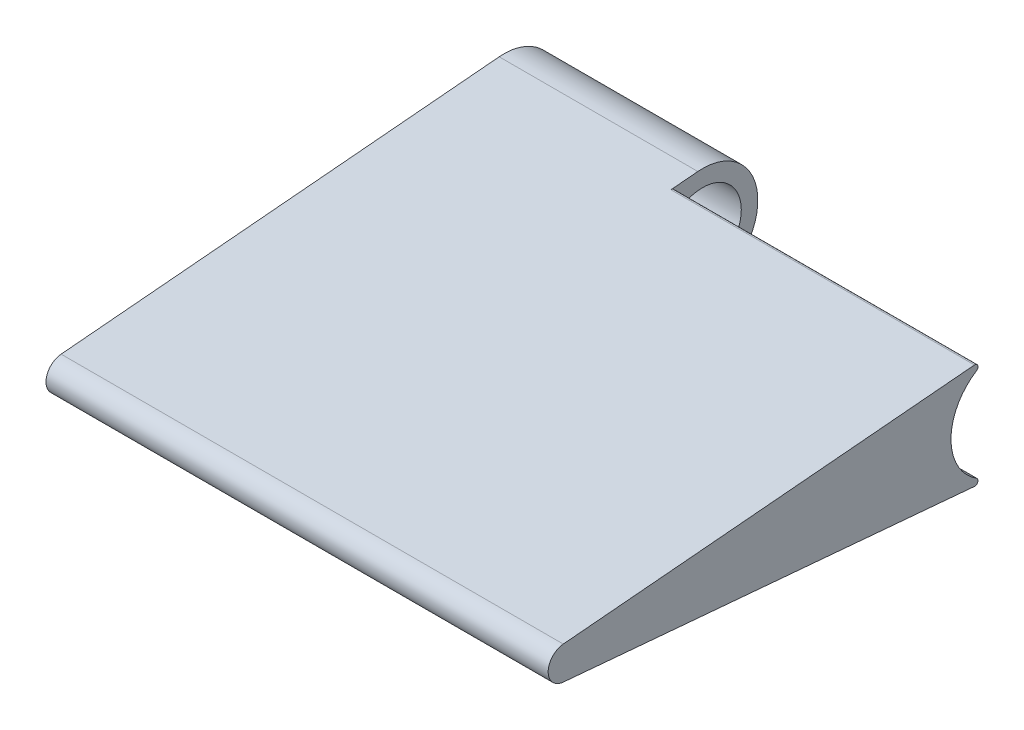
ISO-10303-21;
HEADER;
FILE_DESCRIPTION(('STEP AP214'),'2;1');
FILE_NAME('part.step','',(''),(''),'','','');
FILE_SCHEMA(('AUTOMOTIVE_DESIGN { 1 0 10303 214 1 1 1 1 }'));
ENDSEC;
DATA;
#1=APPLICATION_CONTEXT('core data for automotive mechanical design processes');
#2=APPLICATION_PROTOCOL_DEFINITION('international standard','automotive_design',2000,#1);
#3=PRODUCT_CONTEXT('',#1,'mechanical');
#4=PRODUCT('Part','Part','',(#3));
#5=PRODUCT_RELATED_PRODUCT_CATEGORY('part','',(#4));
#6=PRODUCT_DEFINITION_FORMATION('','',#4);
#7=PRODUCT_DEFINITION_CONTEXT('part definition',#1,'design');
#8=PRODUCT_DEFINITION('design','',#6,#7);
#9=PRODUCT_DEFINITION_SHAPE('','',#8);
#10=(LENGTH_UNIT() NAMED_UNIT(*) SI_UNIT(.MILLI.,.METRE.));
#11=(NAMED_UNIT(*) PLANE_ANGLE_UNIT() SI_UNIT($,.RADIAN.));
#12=(NAMED_UNIT(*) SI_UNIT($,.STERADIAN.) SOLID_ANGLE_UNIT());
#13=UNCERTAINTY_MEASURE_WITH_UNIT(LENGTH_MEASURE(1.E-05),#10,'distance_accuracy_value','');
#14=(GEOMETRIC_REPRESENTATION_CONTEXT(3) GLOBAL_UNCERTAINTY_ASSIGNED_CONTEXT((#13)) GLOBAL_UNIT_ASSIGNED_CONTEXT((#10,
#11,#12)) REPRESENTATION_CONTEXT('',''));
#15=CARTESIAN_POINT('',(0.,0.,0.));
#16=DIRECTION('',(0.,0.,1.));
#17=DIRECTION('',(1.,0.,0.));
#18=AXIS2_PLACEMENT_3D('',#15,#16,#17);
#19=CARTESIAN_POINT('',(27.5,-6.62708288224904,-18.304740975765));
#20=DIRECTION('',(0.,0.996164519544839,-0.0875));
#21=DIRECTION('',(0.,0.0875,0.996164519544839));
#22=AXIS2_PLACEMENT_3D('',#19,#20,#21);
#23=PLANE('',#22);
#24=DIRECTION('',(-1.,0.,0.));
#25=VECTOR('',#24,1.);
#26=CARTESIAN_POINT('',(27.4999999999999,-1.8,36.6503298836491));
#27=LINE('',#26,#25);
#28=CARTESIAN_POINT('',(0.,-1.8,36.650329883649));
#29=VERTEX_POINT('',#28);
#30=CARTESIAN_POINT('',(-18.,-1.8,36.650329883649));
#31=VERTEX_POINT('',#30);
#32=EDGE_CURVE('E137',#29,#31,#27,.T.);
#33=ORIENTED_EDGE('',*,*,#32,.F.);
#34=DIRECTION('',(0.,0.0875,0.996164519544839));
#35=VECTOR('',#34,1.);
#36=CARTESIAN_POINT('',(0.,-6.62708288224904,-18.304740975765));
#37=LINE('',#36,#35);
#38=CARTESIAN_POINT('',(0.,-4.49222985982746,6.));
#39=VERTEX_POINT('',#38);
#40=EDGE_CURVE('E11',#39,#29,#37,.T.);
#41=ORIENTED_EDGE('',*,*,#40,.F.);
#42=DIRECTION('',(1.,0.,0.));
#43=VECTOR('',#42,1.);
#44=CARTESIAN_POINT('',(27.5,-4.49222985982746,6.));
#45=LINE('',#44,#43);
#46=CARTESIAN_POINT('',(-18.,-4.49222985982746,6.));
#47=VERTEX_POINT('',#46);
#48=EDGE_CURVE('E124',#47,#39,#45,.T.);
#49=ORIENTED_EDGE('',*,*,#48,.F.);
#50=DIRECTION('',(0.,-0.0875,-0.996164519544839));
#51=VECTOR('',#50,1.);
#52=CARTESIAN_POINT('',(-18.,-6.62708288224904,-18.304740975765));
#53=LINE('',#52,#51);
#54=CARTESIAN_POINT('',(-18.,-4.9808225977242,0.437499999999997));
#55=VERTEX_POINT('',#54);
#56=EDGE_CURVE('E146',#47,#55,#53,.T.);
#57=ORIENTED_EDGE('',*,*,#56,.T.);
#58=DIRECTION('',(1.,0.,0.));
#59=VECTOR('',#58,1.);
#60=CARTESIAN_POINT('',(-18.,-4.9808225977242,0.437499999999997));
#61=LINE('',#60,#59);
#62=CARTESIAN_POINT('',(0.,-4.9808225977242,0.437499999999997));
#63=VERTEX_POINT('',#62);
#64=EDGE_CURVE('E156',#55,#63,#61,.T.);
#65=ORIENTED_EDGE('',*,*,#64,.T.);
#66=DIRECTION('',(0.,0.0875,0.996164519544839));
#67=VECTOR('',#66,1.);
#68=CARTESIAN_POINT('',(0.,-6.62708288224904,-18.304740975765));
#69=LINE('',#68,#67);
#70=CARTESIAN_POINT('',(0.,-4.76649224523067,2.87759477274961));
#71=VERTEX_POINT('',#70);
#72=EDGE_CURVE('E57',#63,#71,#69,.T.);
#73=ORIENTED_EDGE('',*,*,#72,.T.);
#74=DIRECTION('',(1.,0.,0.));
#75=VECTOR('',#74,1.);
#76=CARTESIAN_POINT('',(27.5,-4.76649224523067,2.87759477274961));
#77=LINE('',#76,#75);
#78=CARTESIAN_POINT('',(27.5,-4.76649224523067,2.87759477274962));
#79=VERTEX_POINT('',#78);
#80=EDGE_CURVE('E187',#71,#79,#77,.T.);
#81=ORIENTED_EDGE('',*,*,#80,.T.);
#82=DIRECTION('',(0.,-0.0875,-0.996164519544839));
#83=VECTOR('',#82,1.);
#84=CARTESIAN_POINT('',(27.5,-6.62708288224904,-18.304740975765));
#85=LINE('',#84,#83);
#86=CARTESIAN_POINT('',(27.5,-1.49424677931726,40.13125));
#87=VERTEX_POINT('',#86);
#88=EDGE_CURVE('E170',#87,#79,#85,.T.);
#89=ORIENTED_EDGE('',*,*,#88,.F.);
#90=DIRECTION('',(-1.,0.,0.));
#91=VECTOR('',#90,1.);
#92=CARTESIAN_POINT('',(27.5,-1.49424677931726,40.13125));
#93=LINE('',#92,#91);
#94=CARTESIAN_POINT('',(-18.,-1.49424677931726,40.13125));
#95=VERTEX_POINT('',#94);
#96=EDGE_CURVE('E176',#87,#95,#93,.T.);
#97=ORIENTED_EDGE('',*,*,#96,.T.);
#98=EDGE_CURVE('E147',#95,#31,#53,.T.);
#99=ORIENTED_EDGE('',*,*,#98,.T.);
#100=EDGE_LOOP('',(#33,#41,#49,#57,#65,#73,#81,#89,#97,#99));
#101=FACE_BOUND('',#100,.T.);
#102=ADVANCED_FACE('F34',(#101),#23,.F.);
#103=CARTESIAN_POINT('',(-18.,0.,-18.886843370319));
#104=DIRECTION('',(1.,0.,0.));
#105=DIRECTION('',(0.,0.,-1.));
#106=AXIS2_PLACEMENT_3D('',#103,#104,#105);
#107=PLANE('',#106);
#108=CARTESIAN_POINT('',(-18.,0.,0.));
#109=DIRECTION('',(1.,0.,0.));
#110=DIRECTION('',(0.,0.,-1.));
#111=AXIS2_PLACEMENT_3D('',#108,#109,#110);
#112=CIRCLE('',#111,3.5);
#113=CARTESIAN_POINT('',(-18.,0.,-3.5));
#114=VERTEX_POINT('',#113);
#115=EDGE_CURVE('E153',#114,#114,#112,.T.);
#116=ORIENTED_EDGE('',*,*,#115,.T.);
#117=EDGE_LOOP('',(#116));
#118=FACE_BOUND('',#117,.T.);
#119=DIRECTION('',(0.,0.,-1.));
#120=VECTOR('',#119,1.);
#121=CARTESIAN_POINT('',(-18.,-1.8,-18.886843370319));
#122=LINE('',#121,#120);
#123=CARTESIAN_POINT('',(-18.,-1.8,6.));
#124=VERTEX_POINT('',#123);
#125=EDGE_CURVE('E42',#31,#124,#122,.T.);
#126=ORIENTED_EDGE('',*,*,#125,.F.);
#127=ORIENTED_EDGE('',*,*,#98,.F.);
#128=CARTESIAN_POINT('',(-18.,0.,40.));
#129=DIRECTION('',(1.,0.,0.));
#130=DIRECTION('',(0.,0.,-1.));
#131=AXIS2_PLACEMENT_3D('',#128,#129,#130);
#132=CIRCLE('',#131,1.5);
#133=CARTESIAN_POINT('',(-18.,1.49424677931726,40.13125));
#134=VERTEX_POINT('',#133);
#135=EDGE_CURVE('E142',#134,#95,#132,.T.);
#136=ORIENTED_EDGE('',*,*,#135,.F.);
#137=DIRECTION('',(0.,0.0875,-0.996164519544839));
#138=VECTOR('',#137,1.);
#139=CARTESIAN_POINT('',(-18.,6.62708288224904,-18.304740975765));
#140=LINE('',#139,#138);
#141=CARTESIAN_POINT('',(-18.,4.9808225977242,0.437499999999997));
#142=VERTEX_POINT('',#141);
#143=EDGE_CURVE('E140',#134,#142,#140,.T.);
#144=ORIENTED_EDGE('',*,*,#143,.T.);
#145=CARTESIAN_POINT('',(-18.,0.,0.));
#146=DIRECTION('',(1.,0.,0.));
#147=DIRECTION('',(0.,0.,-1.));
#148=AXIS2_PLACEMENT_3D('',#145,#146,#147);
#149=CIRCLE('',#148,5.);
#150=EDGE_CURVE('E150',#55,#142,#149,.T.);
#151=ORIENTED_EDGE('',*,*,#150,.F.);
#152=ORIENTED_EDGE('',*,*,#56,.F.);
#153=DIRECTION('',(0.,-1.,0.));
#154=VECTOR('',#153,1.);
#155=CARTESIAN_POINT('',(-18.,-6.13028373982871,6.));
#156=LINE('',#155,#154);
#157=EDGE_CURVE('E125',#124,#47,#156,.T.);
#158=ORIENTED_EDGE('',*,*,#157,.F.);
#159=EDGE_LOOP('',(#126,#127,#136,#144,#151,#152,#158));
#160=FACE_BOUND('',#159,.T.);
#161=ADVANCED_FACE('F239',(#118,#160),#107,.F.);
#162=CARTESIAN_POINT('',(27.5,6.62708288224904,-18.304740975765));
#163=DIRECTION('',(0.,0.996164519544839,0.0875));
#164=DIRECTION('',(0.,-0.0875,0.996164519544839));
#165=AXIS2_PLACEMENT_3D('',#162,#163,#164);
#166=PLANE('',#165);
#167=DIRECTION('',(0.,0.0875,-0.996164519544839));
#168=VECTOR('',#167,1.);
#169=CARTESIAN_POINT('',(27.5,6.62708288224904,-18.304740975765));
#170=LINE('',#169,#168);
#171=CARTESIAN_POINT('',(27.5,1.49424677931726,40.13125));
#172=VERTEX_POINT('',#171);
#173=CARTESIAN_POINT('',(27.5,4.76649224523067,2.87759477274962));
#174=VERTEX_POINT('',#173);
#175=EDGE_CURVE('E165',#172,#174,#170,.T.);
#176=ORIENTED_EDGE('',*,*,#175,.T.);
#177=DIRECTION('',(-1.,0.,0.));
#178=VECTOR('',#177,1.);
#179=CARTESIAN_POINT('',(27.5,4.76649224523067,2.87759477274962));
#180=LINE('',#179,#178);
#181=CARTESIAN_POINT('',(0.,4.76649224523067,2.87759477274961));
#182=VERTEX_POINT('',#181);
#183=EDGE_CURVE('E196',#174,#182,#180,.T.);
#184=ORIENTED_EDGE('',*,*,#183,.T.);
#185=DIRECTION('',(0.,0.0875,-0.996164519544839));
#186=VECTOR('',#185,1.);
#187=CARTESIAN_POINT('',(0.,6.62708288224904,-18.304740975765));
#188=LINE('',#187,#186);
#189=CARTESIAN_POINT('',(0.,4.9808225977242,0.437499999999997));
#190=VERTEX_POINT('',#189);
#191=EDGE_CURVE('E194',#182,#190,#188,.T.);
#192=ORIENTED_EDGE('',*,*,#191,.T.);
#193=DIRECTION('',(1.,0.,0.));
#194=VECTOR('',#193,1.);
#195=CARTESIAN_POINT('',(-18.,4.9808225977242,0.437499999999997));
#196=LINE('',#195,#194);
#197=EDGE_CURVE('E160',#142,#190,#196,.T.);
#198=ORIENTED_EDGE('',*,*,#197,.F.);
#199=ORIENTED_EDGE('',*,*,#143,.F.);
#200=DIRECTION('',(-1.,0.,0.));
#201=VECTOR('',#200,1.);
#202=CARTESIAN_POINT('',(27.5,1.49424677931726,40.13125));
#203=LINE('',#202,#201);
#204=EDGE_CURVE('E180',#172,#134,#203,.T.);
#205=ORIENTED_EDGE('',*,*,#204,.F.);
#206=EDGE_LOOP('',(#176,#184,#192,#198,#199,#205));
#207=FACE_BOUND('',#206,.T.);
#208=ADVANCED_FACE('F218',(#207),#166,.T.);
#209=CARTESIAN_POINT('',(27.5,0.,40.));
#210=DIRECTION('',(-1.,0.,0.));
#211=DIRECTION('',(0.,0.,1.));
#212=AXIS2_PLACEMENT_3D('',#209,#210,#211);
#213=CYLINDRICAL_SURFACE('',#212,1.5);
#214=ORIENTED_EDGE('',*,*,#204,.T.);
#215=ORIENTED_EDGE('',*,*,#135,.T.);
#216=ORIENTED_EDGE('',*,*,#96,.F.);
#217=CARTESIAN_POINT('',(27.5,0.,40.));
#218=DIRECTION('',(1.,0.,0.));
#219=DIRECTION('',(0.,0.,-1.));
#220=AXIS2_PLACEMENT_3D('',#217,#218,#219);
#221=CIRCLE('',#220,1.5);
#222=EDGE_CURVE('E168',#172,#87,#221,.T.);
#223=ORIENTED_EDGE('',*,*,#222,.F.);
#224=EDGE_LOOP('',(#214,#215,#216,#223));
#225=FACE_BOUND('',#224,.T.);
#226=ADVANCED_FACE('F225',(#225),#213,.T.);
#227=CARTESIAN_POINT('',(27.5,0.,0.));
#228=DIRECTION('',(-1.,0.,0.));
#229=DIRECTION('',(0.,0.,1.));
#230=AXIS2_PLACEMENT_3D('',#227,#228,#229);
#231=CYLINDRICAL_SURFACE('',#230,5.);
#232=CARTESIAN_POINT('',(27.5,0.,0.));
#233=DIRECTION('',(1.,0.,0.));
#234=DIRECTION('',(0.,0.,-1.));
#235=AXIS2_PLACEMENT_3D('',#232,#233,#234);
#236=CIRCLE('',#235,5.);
#237=CARTESIAN_POINT('',(27.5,4.21475744279926,2.68994789882039));
#238=VERTEX_POINT('',#237);
#239=CARTESIAN_POINT('',(27.5,-4.21475744279926,2.68994789882039));
#240=VERTEX_POINT('',#239);
#241=EDGE_CURVE('E173',#238,#240,#236,.T.);
#242=ORIENTED_EDGE('',*,*,#241,.T.);
#243=DIRECTION('',(-1.,0.,0.));
#244=VECTOR('',#243,1.);
#245=CARTESIAN_POINT('',(27.5,-4.21475744279926,2.68994789882039));
#246=LINE('',#245,#244);
#247=CARTESIAN_POINT('',(0.,-4.21475744279926,2.68994789882039));
#248=VERTEX_POINT('',#247);
#249=EDGE_CURVE('E184',#240,#248,#246,.T.);
#250=ORIENTED_EDGE('',*,*,#249,.T.);
#251=CARTESIAN_POINT('',(0.,0.,0.));
#252=DIRECTION('',(1.,0.,0.));
#253=DIRECTION('',(0.,0.,-1.));
#254=AXIS2_PLACEMENT_3D('',#251,#252,#253);
#255=CIRCLE('',#254,5.);
#256=CARTESIAN_POINT('',(0.,4.21475744279926,2.68994789882039));
#257=VERTEX_POINT('',#256);
#258=EDGE_CURVE('E163',#257,#248,#255,.T.);
#259=ORIENTED_EDGE('',*,*,#258,.F.);
#260=DIRECTION('',(-1.,0.,0.));
#261=VECTOR('',#260,1.);
#262=CARTESIAN_POINT('',(27.5,4.21475744279926,2.68994789882039));
#263=LINE('',#262,#261);
#264=EDGE_CURVE('E182',#257,#238,#263,.F.);
#265=ORIENTED_EDGE('',*,*,#264,.T.);
#266=EDGE_LOOP('',(#242,#250,#259,#265));
#267=FACE_BOUND('',#266,.T.);
#268=ADVANCED_FACE('F210',(#267),#231,.F.);
#269=CARTESIAN_POINT('',(27.5,0.,-18.886843370319));
#270=DIRECTION('',(1.,0.,0.));
#271=DIRECTION('',(0.,0.,-1.));
#272=AXIS2_PLACEMENT_3D('',#269,#270,#271);
#273=PLANE('',#272);
#274=ORIENTED_EDGE('',*,*,#88,.T.);
#275=CARTESIAN_POINT('',(27.5,-4.46764288936722,2.85134477274961));
#276=DIRECTION('',(1.,0.,0.));
#277=DIRECTION('',(0.,0.,-1.));
#278=AXIS2_PLACEMENT_3D('',#275,#276,#277);
#279=CIRCLE('',#278,0.3);
#280=EDGE_CURVE('E192',#79,#240,#279,.T.);
#281=ORIENTED_EDGE('',*,*,#280,.T.);
#282=ORIENTED_EDGE('',*,*,#241,.F.);
#283=CARTESIAN_POINT('',(27.5,4.46764288936722,2.85134477274961));
#284=DIRECTION('',(1.,0.,0.));
#285=DIRECTION('',(0.,0.,-1.));
#286=AXIS2_PLACEMENT_3D('',#283,#284,#285);
#287=CIRCLE('',#286,0.3);
#288=EDGE_CURVE('E190',#238,#174,#287,.T.);
#289=ORIENTED_EDGE('',*,*,#288,.T.);
#290=ORIENTED_EDGE('',*,*,#175,.F.);
#291=ORIENTED_EDGE('',*,*,#222,.T.);
#292=EDGE_LOOP('',(#274,#281,#282,#289,#290,#291));
#293=FACE_BOUND('',#292,.T.);
#294=ADVANCED_FACE('F216',(#293),#273,.T.);
#295=CARTESIAN_POINT('',(-18.,0.,0.));
#296=DIRECTION('',(1.,0.,0.));
#297=DIRECTION('',(0.,0.,-1.));
#298=AXIS2_PLACEMENT_3D('',#295,#296,#297);
#299=CYLINDRICAL_SURFACE('',#298,5.);
#300=CARTESIAN_POINT('',(0.,0.,0.));
#301=DIRECTION('',(1.,0.,0.));
#302=DIRECTION('',(0.,0.,-1.));
#303=AXIS2_PLACEMENT_3D('',#300,#301,#302);
#304=CIRCLE('',#303,5.);
#305=EDGE_CURVE('E139',#63,#190,#304,.T.);
#306=ORIENTED_EDGE('',*,*,#305,.F.);
#307=ORIENTED_EDGE('',*,*,#64,.F.);
#308=ORIENTED_EDGE('',*,*,#150,.T.);
#309=ORIENTED_EDGE('',*,*,#197,.T.);
#310=EDGE_LOOP('',(#306,#307,#308,#309));
#311=FACE_BOUND('',#310,.T.);
#312=ADVANCED_FACE('F237',(#311),#299,.T.);
#313=CARTESIAN_POINT('',(-18.,0.,0.));
#314=DIRECTION('',(1.,0.,0.));
#315=DIRECTION('',(0.,0.,-1.));
#316=AXIS2_PLACEMENT_3D('',#313,#314,#315);
#317=CYLINDRICAL_SURFACE('',#316,3.5);
#318=ORIENTED_EDGE('',*,*,#115,.F.);
#319=EDGE_LOOP('',(#318));
#320=FACE_BOUND('',#319,.T.);
#321=CARTESIAN_POINT('',(0.,0.,0.));
#322=DIRECTION('',(1.,0.,0.));
#323=DIRECTION('',(0.,0.,-1.));
#324=AXIS2_PLACEMENT_3D('',#321,#322,#323);
#325=CIRCLE('',#324,3.5);
#326=CARTESIAN_POINT('',(0.,0.,-3.5));
#327=VERTEX_POINT('',#326);
#328=EDGE_CURVE('E143',#327,#327,#325,.T.);
#329=ORIENTED_EDGE('',*,*,#328,.T.);
#330=EDGE_LOOP('',(#329));
#331=FACE_BOUND('',#330,.T.);
#332=ADVANCED_FACE('F255',(#320,#331),#317,.F.);
#333=CARTESIAN_POINT('',(0.,0.,-18.886843370319));
#334=DIRECTION('',(1.,0.,0.));
#335=DIRECTION('',(0.,0.,-1.));
#336=AXIS2_PLACEMENT_3D('',#333,#334,#335);
#337=PLANE('',#336);
#338=ORIENTED_EDGE('',*,*,#305,.T.);
#339=ORIENTED_EDGE('',*,*,#191,.F.);
#340=CARTESIAN_POINT('',(0.,4.46764288936722,2.85134477274961));
#341=DIRECTION('',(1.,0.,0.));
#342=DIRECTION('',(0.,0.,-1.));
#343=AXIS2_PLACEMENT_3D('',#340,#341,#342);
#344=CIRCLE('',#343,0.3);
#345=EDGE_CURVE('E201',#182,#257,#344,.F.);
#346=ORIENTED_EDGE('',*,*,#345,.T.);
#347=ORIENTED_EDGE('',*,*,#258,.T.);
#348=CARTESIAN_POINT('',(0.,-4.46764288936722,2.85134477274961));
#349=DIRECTION('',(1.,0.,0.));
#350=DIRECTION('',(0.,0.,-1.));
#351=AXIS2_PLACEMENT_3D('',#348,#349,#350);
#352=CIRCLE('',#351,0.3);
#353=EDGE_CURVE('E199',#248,#71,#352,.F.);
#354=ORIENTED_EDGE('',*,*,#353,.T.);
#355=ORIENTED_EDGE('',*,*,#72,.F.);
#356=EDGE_LOOP('',(#338,#339,#346,#347,#354,#355));
#357=FACE_BOUND('',#356,.T.);
#358=ORIENTED_EDGE('',*,*,#328,.F.);
#359=EDGE_LOOP('',(#358));
#360=FACE_BOUND('',#359,.T.);
#361=ADVANCED_FACE('F204',(#357,#360),#337,.T.);
#362=CARTESIAN_POINT('',(27.5,-4.46764288936722,2.85134477274961));
#363=DIRECTION('',(-1.,0.,0.));
#364=DIRECTION('',(0.,0.,1.));
#365=AXIS2_PLACEMENT_3D('',#362,#363,#364);
#366=CYLINDRICAL_SURFACE('',#365,0.3);
#367=ORIENTED_EDGE('',*,*,#280,.F.);
#368=ORIENTED_EDGE('',*,*,#80,.F.);
#369=ORIENTED_EDGE('',*,*,#353,.F.);
#370=ORIENTED_EDGE('',*,*,#249,.F.);
#371=EDGE_LOOP('',(#367,#368,#369,#370));
#372=FACE_BOUND('',#371,.T.);
#373=ADVANCED_FACE('F231',(#372),#366,.T.);
#374=CARTESIAN_POINT('',(27.5,4.46764288936722,2.85134477274961));
#375=DIRECTION('',(-1.,0.,0.));
#376=DIRECTION('',(0.,0.,1.));
#377=AXIS2_PLACEMENT_3D('',#374,#375,#376);
#378=CYLINDRICAL_SURFACE('',#377,0.3);
#379=ORIENTED_EDGE('',*,*,#288,.F.);
#380=ORIENTED_EDGE('',*,*,#264,.F.);
#381=ORIENTED_EDGE('',*,*,#345,.F.);
#382=ORIENTED_EDGE('',*,*,#183,.F.);
#383=EDGE_LOOP('',(#379,#380,#381,#382));
#384=FACE_BOUND('',#383,.T.);
#385=ADVANCED_FACE('F36',(#384),#378,.T.);
#386=CARTESIAN_POINT('',(0.,-6.13028373982871,54.));
#387=DIRECTION('',(-1.,0.,0.));
#388=DIRECTION('',(0.,0.,1.));
#389=AXIS2_PLACEMENT_3D('',#386,#387,#388);
#390=PLANE('',#389);
#391=ORIENTED_EDGE('',*,*,#40,.T.);
#392=DIRECTION('',(0.,0.,-1.));
#393=VECTOR('',#392,1.);
#394=CARTESIAN_POINT('',(0.,-1.8,54.));
#395=LINE('',#394,#393);
#396=CARTESIAN_POINT('',(0.,-1.8,6.));
#397=VERTEX_POINT('',#396);
#398=EDGE_CURVE('E118',#29,#397,#395,.T.);
#399=ORIENTED_EDGE('',*,*,#398,.T.);
#400=DIRECTION('',(0.,1.,0.));
#401=VECTOR('',#400,1.);
#402=CARTESIAN_POINT('',(0.,-6.13028373982871,6.));
#403=LINE('',#402,#401);
#404=EDGE_CURVE('E120',#39,#397,#403,.T.);
#405=ORIENTED_EDGE('',*,*,#404,.F.);
#406=EDGE_LOOP('',(#391,#399,#405));
#407=FACE_BOUND('',#406,.T.);
#408=ADVANCED_FACE('F119',(#407),#390,.T.);
#409=CARTESIAN_POINT('',(0.,-1.8,54.));
#410=DIRECTION('',(0.,-1.,0.));
#411=DIRECTION('',(1.,0.,0.));
#412=AXIS2_PLACEMENT_3D('',#409,#410,#411);
#413=PLANE('',#412);
#414=ORIENTED_EDGE('',*,*,#32,.T.);
#415=ORIENTED_EDGE('',*,*,#125,.T.);
#416=DIRECTION('',(-1.,0.,0.));
#417=VECTOR('',#416,1.);
#418=CARTESIAN_POINT('',(0.,-1.8,6.));
#419=LINE('',#418,#417);
#420=EDGE_CURVE('E49',#397,#124,#419,.T.);
#421=ORIENTED_EDGE('',*,*,#420,.F.);
#422=ORIENTED_EDGE('',*,*,#398,.F.);
#423=EDGE_LOOP('',(#414,#415,#421,#422));
#424=FACE_BOUND('',#423,.T.);
#425=ADVANCED_FACE('F130',(#424),#413,.T.);
#426=CARTESIAN_POINT('',(0.,-1.8,6.));
#427=DIRECTION('',(0.,0.,1.));
#428=DIRECTION('',(1.,0.,0.));
#429=AXIS2_PLACEMENT_3D('',#426,#427,#428);
#430=PLANE('',#429);
#431=ORIENTED_EDGE('',*,*,#48,.T.);
#432=ORIENTED_EDGE('',*,*,#404,.T.);
#433=ORIENTED_EDGE('',*,*,#420,.T.);
#434=ORIENTED_EDGE('',*,*,#157,.T.);
#435=EDGE_LOOP('',(#431,#432,#433,#434));
#436=FACE_BOUND('',#435,.T.);
#437=ADVANCED_FACE('F127',(#436),#430,.T.);
#438=CLOSED_SHELL('',(#102,#161,#208,#226,#268,#294,#312,#332,#361,#373,#385,#408,#425,#437));
#439=MANIFOLD_SOLID_BREP('B2',#438);
#440=ADVANCED_BREP_SHAPE_REPRESENTATION('',(#18,#439),#14);
#441=SHAPE_DEFINITION_REPRESENTATION(#9,#440);
ENDSEC;
END-ISO-10303-21;
